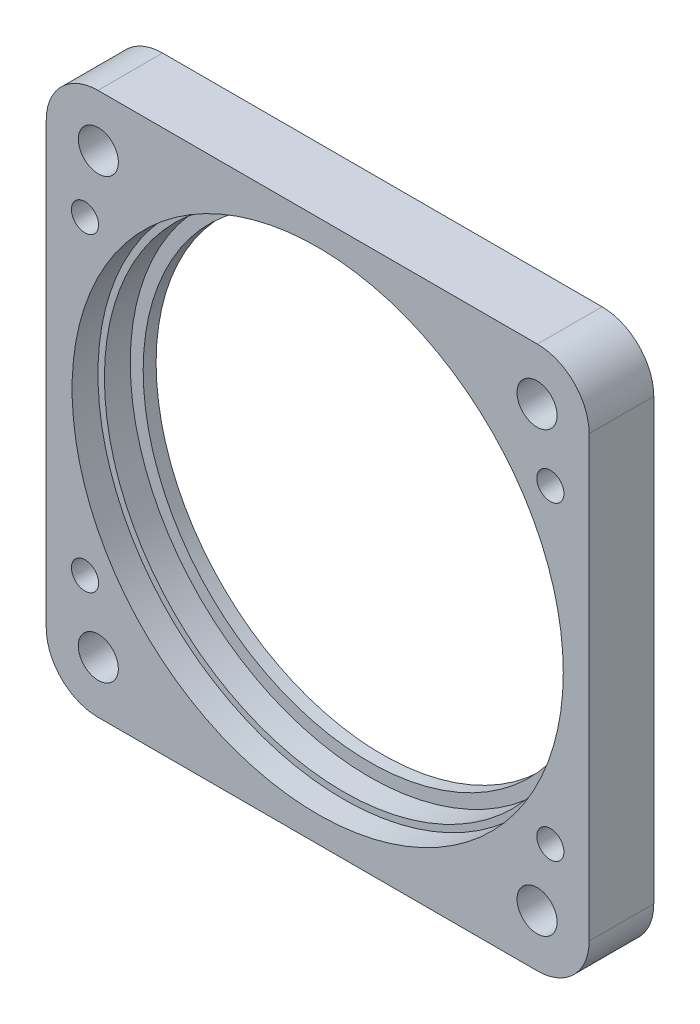
ISO-10303-21;
HEADER;
FILE_DESCRIPTION(('STEP AP214'),'2;1');
FILE_NAME('part.step','',(''),(''),'','','');
FILE_SCHEMA(('AUTOMOTIVE_DESIGN { 1 0 10303 214 1 1 1 1 }'));
ENDSEC;
DATA;
#1=APPLICATION_CONTEXT('core data for automotive mechanical design processes');
#2=APPLICATION_PROTOCOL_DEFINITION('international standard','automotive_design',2000,#1);
#3=PRODUCT_CONTEXT('',#1,'mechanical');
#4=PRODUCT('Part','Part','',(#3));
#5=PRODUCT_RELATED_PRODUCT_CATEGORY('part','',(#4));
#6=PRODUCT_DEFINITION_FORMATION('','',#4);
#7=PRODUCT_DEFINITION_CONTEXT('part definition',#1,'design');
#8=PRODUCT_DEFINITION('design','',#6,#7);
#9=PRODUCT_DEFINITION_SHAPE('','',#8);
#10=(LENGTH_UNIT() NAMED_UNIT(*) SI_UNIT(.MILLI.,.METRE.));
#11=(NAMED_UNIT(*) PLANE_ANGLE_UNIT() SI_UNIT($,.RADIAN.));
#12=(NAMED_UNIT(*) SI_UNIT($,.STERADIAN.) SOLID_ANGLE_UNIT());
#13=UNCERTAINTY_MEASURE_WITH_UNIT(LENGTH_MEASURE(1.E-05),#10,'distance_accuracy_value','');
#14=(GEOMETRIC_REPRESENTATION_CONTEXT(3) GLOBAL_UNCERTAINTY_ASSIGNED_CONTEXT((#13)) GLOBAL_UNIT_ASSIGNED_CONTEXT((#10,
#11,#12)) REPRESENTATION_CONTEXT('',''));
#15=CARTESIAN_POINT('',(0.,0.,0.));
#16=DIRECTION('',(0.,0.,1.));
#17=DIRECTION('',(1.,0.,0.));
#18=AXIS2_PLACEMENT_3D('',#15,#16,#17);
#19=CARTESIAN_POINT('',(18.,12.,5.));
#20=DIRECTION('',(0.,0.,-1.));
#21=DIRECTION('',(-1.,0.,0.));
#22=AXIS2_PLACEMENT_3D('',#19,#20,#21);
#23=CYLINDRICAL_SURFACE('',#22,1.05);
#24=CARTESIAN_POINT('',(18.,12.,5.));
#25=DIRECTION('',(0.,0.,-1.));
#26=DIRECTION('',(-1.,0.,0.));
#27=AXIS2_PLACEMENT_3D('',#24,#25,#26);
#28=CIRCLE('',#27,1.05);
#29=CARTESIAN_POINT('',(16.95,12.,5.));
#30=VERTEX_POINT('',#29);
#31=EDGE_CURVE('E196',#30,#30,#28,.T.);
#32=ORIENTED_EDGE('',*,*,#31,.F.);
#33=EDGE_LOOP('',(#32));
#34=FACE_BOUND('',#33,.T.);
#35=CARTESIAN_POINT('',(18.,12.,3.));
#36=DIRECTION('',(0.,0.,-1.));
#37=DIRECTION('',(-1.,0.,0.));
#38=AXIS2_PLACEMENT_3D('',#35,#36,#37);
#39=CIRCLE('',#38,1.05);
#40=CARTESIAN_POINT('',(16.95,12.,3.));
#41=VERTEX_POINT('',#40);
#42=EDGE_CURVE('E43',#41,#41,#39,.F.);
#43=ORIENTED_EDGE('',*,*,#42,.F.);
#44=EDGE_LOOP('',(#43));
#45=FACE_BOUND('',#44,.T.);
#46=ADVANCED_FACE('F39',(#34,#45),#23,.F.);
#47=CARTESIAN_POINT('',(-18.,-12.,5.));
#48=DIRECTION('',(0.,0.,-1.));
#49=DIRECTION('',(-1.,0.,0.));
#50=AXIS2_PLACEMENT_3D('',#47,#48,#49);
#51=CYLINDRICAL_SURFACE('',#50,1.05);
#52=CARTESIAN_POINT('',(-18.,-12.,5.));
#53=DIRECTION('',(0.,0.,-1.));
#54=DIRECTION('',(-1.,0.,0.));
#55=AXIS2_PLACEMENT_3D('',#52,#53,#54);
#56=CIRCLE('',#55,1.05);
#57=CARTESIAN_POINT('',(-19.05,-12.,5.));
#58=VERTEX_POINT('',#57);
#59=EDGE_CURVE('E187',#58,#58,#56,.T.);
#60=ORIENTED_EDGE('',*,*,#59,.F.);
#61=EDGE_LOOP('',(#60));
#62=FACE_BOUND('',#61,.T.);
#63=CARTESIAN_POINT('',(-18.,-12.,3.));
#64=DIRECTION('',(0.,0.,-1.));
#65=DIRECTION('',(-1.,0.,0.));
#66=AXIS2_PLACEMENT_3D('',#63,#64,#65);
#67=CIRCLE('',#66,1.05);
#68=CARTESIAN_POINT('',(-19.05,-12.,3.));
#69=VERTEX_POINT('',#68);
#70=EDGE_CURVE('E175',#69,#69,#67,.F.);
#71=ORIENTED_EDGE('',*,*,#70,.F.);
#72=EDGE_LOOP('',(#71));
#73=FACE_BOUND('',#72,.T.);
#74=ADVANCED_FACE('F259',(#62,#73),#51,.F.);
#75=CARTESIAN_POINT('',(0.,0.,-52.3259018078045));
#76=DIRECTION('',(0.,0.,1.));
#77=DIRECTION('',(1.,0.,0.));
#78=AXIS2_PLACEMENT_3D('',#75,#76,#77);
#79=CYLINDRICAL_SURFACE('',#78,18.5);
#80=CARTESIAN_POINT('',(0.,0.,1.));
#81=DIRECTION('',(0.,0.,1.));
#82=DIRECTION('',(1.,0.,0.));
#83=AXIS2_PLACEMENT_3D('',#80,#81,#82);
#84=CIRCLE('',#83,18.5);
#85=CARTESIAN_POINT('',(18.5,0.,1.));
#86=VERTEX_POINT('',#85);
#87=EDGE_CURVE('E146',#86,#86,#84,.F.);
#88=ORIENTED_EDGE('',*,*,#87,.T.);
#89=EDGE_LOOP('',(#88));
#90=FACE_BOUND('',#89,.T.);
#91=CARTESIAN_POINT('',(0.,0.,3.));
#92=DIRECTION('',(0.,0.,1.));
#93=DIRECTION('',(1.,0.,0.));
#94=AXIS2_PLACEMENT_3D('',#91,#92,#93);
#95=CIRCLE('',#94,18.5);
#96=CARTESIAN_POINT('',(18.5,0.,3.));
#97=VERTEX_POINT('',#96);
#98=EDGE_CURVE('E147',#97,#97,#95,.F.);
#99=ORIENTED_EDGE('',*,*,#98,.F.);
#100=EDGE_LOOP('',(#99));
#101=FACE_BOUND('',#100,.T.);
#102=ADVANCED_FACE('F265',(#90,#101),#79,.F.);
#103=CARTESIAN_POINT('',(0.,0.,0.));
#104=DIRECTION('',(0.,0.,1.));
#105=DIRECTION('',(1.,0.,0.));
#106=AXIS2_PLACEMENT_3D('',#103,#104,#105);
#107=CYLINDRICAL_SURFACE('',#106,17.5);
#108=CARTESIAN_POINT('',(0.,0.,0.));
#109=DIRECTION('',(0.,0.,1.));
#110=DIRECTION('',(1.,0.,0.));
#111=AXIS2_PLACEMENT_3D('',#108,#109,#110);
#112=CIRCLE('',#111,17.5);
#113=CARTESIAN_POINT('',(17.5,0.,0.));
#114=VERTEX_POINT('',#113);
#115=EDGE_CURVE('E145',#114,#114,#112,.T.);
#116=ORIENTED_EDGE('',*,*,#115,.F.);
#117=EDGE_LOOP('',(#116));
#118=FACE_BOUND('',#117,.T.);
#119=CARTESIAN_POINT('',(0.,0.,1.));
#120=DIRECTION('',(0.,0.,1.));
#121=DIRECTION('',(1.,0.,0.));
#122=AXIS2_PLACEMENT_3D('',#119,#120,#121);
#123=CIRCLE('',#122,17.5);
#124=CARTESIAN_POINT('',(17.5,0.,1.));
#125=VERTEX_POINT('',#124);
#126=EDGE_CURVE('E142',#125,#125,#123,.F.);
#127=ORIENTED_EDGE('',*,*,#126,.F.);
#128=EDGE_LOOP('',(#127));
#129=FACE_BOUND('',#128,.T.);
#130=ADVANCED_FACE('F304',(#118,#129),#107,.F.);
#131=CARTESIAN_POINT('',(21.,21.,5.));
#132=DIRECTION('',(-1.,0.,0.));
#133=DIRECTION('',(0.,-1.,0.));
#134=AXIS2_PLACEMENT_3D('',#131,#132,#133);
#135=PLANE('',#134);
#136=DIRECTION('',(0.,1.,0.));
#137=VECTOR('',#136,1.);
#138=CARTESIAN_POINT('',(21.,21.,5.));
#139=LINE('',#138,#137);
#140=CARTESIAN_POINT('',(21.,-17.,5.));
#141=VERTEX_POINT('',#140);
#142=CARTESIAN_POINT('',(21.,17.,5.));
#143=VERTEX_POINT('',#142);
#144=EDGE_CURVE('E133',#141,#143,#139,.T.);
#145=ORIENTED_EDGE('',*,*,#144,.F.);
#146=DIRECTION('',(0.,0.,-1.));
#147=VECTOR('',#146,1.);
#148=CARTESIAN_POINT('',(21.,-17.,5.));
#149=LINE('',#148,#147);
#150=CARTESIAN_POINT('',(21.,-17.,0.));
#151=VERTEX_POINT('',#150);
#152=EDGE_CURVE('E168',#141,#151,#149,.T.);
#153=ORIENTED_EDGE('',*,*,#152,.T.);
#154=DIRECTION('',(0.,1.,0.));
#155=VECTOR('',#154,1.);
#156=CARTESIAN_POINT('',(21.,21.,0.));
#157=LINE('',#156,#155);
#158=CARTESIAN_POINT('',(21.,17.,0.));
#159=VERTEX_POINT('',#158);
#160=EDGE_CURVE('E231',#151,#159,#157,.T.);
#161=ORIENTED_EDGE('',*,*,#160,.T.);
#162=DIRECTION('',(0.,0.,-1.));
#163=VECTOR('',#162,1.);
#164=CARTESIAN_POINT('',(21.,17.,5.));
#165=LINE('',#164,#163);
#166=EDGE_CURVE('E166',#159,#143,#165,.F.);
#167=ORIENTED_EDGE('',*,*,#166,.T.);
#168=EDGE_LOOP('',(#145,#153,#161,#167));
#169=FACE_BOUND('',#168,.T.);
#170=ADVANCED_FACE('F256',(#169),#135,.F.);
#171=CARTESIAN_POINT('',(-21.,21.,5.));
#172=DIRECTION('',(0.,-1.,0.));
#173=DIRECTION('',(0.,0.,-1.));
#174=AXIS2_PLACEMENT_3D('',#171,#172,#173);
#175=PLANE('',#174);
#176=DIRECTION('',(-1.,0.,0.));
#177=VECTOR('',#176,1.);
#178=CARTESIAN_POINT('',(-21.,21.,5.));
#179=LINE('',#178,#177);
#180=CARTESIAN_POINT('',(17.,21.,5.));
#181=VERTEX_POINT('',#180);
#182=CARTESIAN_POINT('',(-17.,21.,5.));
#183=VERTEX_POINT('',#182);
#184=EDGE_CURVE('E136',#181,#183,#179,.T.);
#185=ORIENTED_EDGE('',*,*,#184,.F.);
#186=DIRECTION('',(0.,0.,-1.));
#187=VECTOR('',#186,1.);
#188=CARTESIAN_POINT('',(17.,21.,5.));
#189=LINE('',#188,#187);
#190=CARTESIAN_POINT('',(17.,21.,0.));
#191=VERTEX_POINT('',#190);
#192=EDGE_CURVE('E13',#181,#191,#189,.T.);
#193=ORIENTED_EDGE('',*,*,#192,.T.);
#194=DIRECTION('',(-1.,0.,0.));
#195=VECTOR('',#194,1.);
#196=CARTESIAN_POINT('',(-21.,21.,0.));
#197=LINE('',#196,#195);
#198=CARTESIAN_POINT('',(-17.,21.,0.));
#199=VERTEX_POINT('',#198);
#200=EDGE_CURVE('E138',#191,#199,#197,.T.);
#201=ORIENTED_EDGE('',*,*,#200,.T.);
#202=DIRECTION('',(0.,0.,-1.));
#203=VECTOR('',#202,1.);
#204=CARTESIAN_POINT('',(-17.,21.,5.));
#205=LINE('',#204,#203);
#206=EDGE_CURVE('E48',#199,#183,#205,.F.);
#207=ORIENTED_EDGE('',*,*,#206,.T.);
#208=EDGE_LOOP('',(#185,#193,#201,#207));
#209=FACE_BOUND('',#208,.T.);
#210=ADVANCED_FACE('F240',(#209),#175,.F.);
#211=CARTESIAN_POINT('',(-21.,21.,5.));
#212=DIRECTION('',(1.,0.,0.));
#213=DIRECTION('',(0.,0.,-1.));
#214=AXIS2_PLACEMENT_3D('',#211,#212,#213);
#215=PLANE('',#214);
#216=DIRECTION('',(0.,-1.,0.));
#217=VECTOR('',#216,1.);
#218=CARTESIAN_POINT('',(-21.,21.,0.));
#219=LINE('',#218,#217);
#220=CARTESIAN_POINT('',(-21.,17.,0.));
#221=VERTEX_POINT('',#220);
#222=CARTESIAN_POINT('',(-21.,-17.,0.));
#223=VERTEX_POINT('',#222);
#224=EDGE_CURVE('E134',#221,#223,#219,.T.);
#225=ORIENTED_EDGE('',*,*,#224,.T.);
#226=DIRECTION('',(0.,0.,-1.));
#227=VECTOR('',#226,1.);
#228=CARTESIAN_POINT('',(-21.,-17.,5.));
#229=LINE('',#228,#227);
#230=CARTESIAN_POINT('',(-21.,-17.,5.));
#231=VERTEX_POINT('',#230);
#232=EDGE_CURVE('E112',#223,#231,#229,.F.);
#233=ORIENTED_EDGE('',*,*,#232,.T.);
#234=DIRECTION('',(0.,-1.,0.));
#235=VECTOR('',#234,1.);
#236=CARTESIAN_POINT('',(-21.,21.,5.));
#237=LINE('',#236,#235);
#238=CARTESIAN_POINT('',(-21.,17.,5.));
#239=VERTEX_POINT('',#238);
#240=EDGE_CURVE('E234',#239,#231,#237,.T.);
#241=ORIENTED_EDGE('',*,*,#240,.F.);
#242=DIRECTION('',(0.,0.,-1.));
#243=VECTOR('',#242,1.);
#244=CARTESIAN_POINT('',(-21.,17.,5.));
#245=LINE('',#244,#243);
#246=EDGE_CURVE('E117',#239,#221,#245,.T.);
#247=ORIENTED_EDGE('',*,*,#246,.T.);
#248=EDGE_LOOP('',(#225,#233,#241,#247));
#249=FACE_BOUND('',#248,.T.);
#250=ADVANCED_FACE('F248',(#249),#215,.F.);
#251=CARTESIAN_POINT('',(-21.,-21.,5.));
#252=DIRECTION('',(0.,1.,0.));
#253=DIRECTION('',(0.,0.,1.));
#254=AXIS2_PLACEMENT_3D('',#251,#252,#253);
#255=PLANE('',#254);
#256=DIRECTION('',(1.,0.,0.));
#257=VECTOR('',#256,1.);
#258=CARTESIAN_POINT('',(-21.,-21.,5.));
#259=LINE('',#258,#257);
#260=CARTESIAN_POINT('',(-17.,-21.,5.));
#261=VERTEX_POINT('',#260);
#262=CARTESIAN_POINT('',(17.,-21.,5.));
#263=VERTEX_POINT('',#262);
#264=EDGE_CURVE('E127',#261,#263,#259,.T.);
#265=ORIENTED_EDGE('',*,*,#264,.F.);
#266=DIRECTION('',(0.,0.,-1.));
#267=VECTOR('',#266,1.);
#268=CARTESIAN_POINT('',(-17.,-21.,5.));
#269=LINE('',#268,#267);
#270=CARTESIAN_POINT('',(-17.,-21.,0.));
#271=VERTEX_POINT('',#270);
#272=EDGE_CURVE('E111',#261,#271,#269,.T.);
#273=ORIENTED_EDGE('',*,*,#272,.T.);
#274=DIRECTION('',(1.,0.,0.));
#275=VECTOR('',#274,1.);
#276=CARTESIAN_POINT('',(-21.,-21.,0.));
#277=LINE('',#276,#275);
#278=CARTESIAN_POINT('',(17.,-21.,0.));
#279=VERTEX_POINT('',#278);
#280=EDGE_CURVE('E124',#271,#279,#277,.T.);
#281=ORIENTED_EDGE('',*,*,#280,.T.);
#282=DIRECTION('',(0.,0.,-1.));
#283=VECTOR('',#282,1.);
#284=CARTESIAN_POINT('',(17.,-21.,5.));
#285=LINE('',#284,#283);
#286=EDGE_CURVE('E129',#279,#263,#285,.F.);
#287=ORIENTED_EDGE('',*,*,#286,.T.);
#288=EDGE_LOOP('',(#265,#273,#281,#287));
#289=FACE_BOUND('',#288,.T.);
#290=ADVANCED_FACE('F123',(#289),#255,.F.);
#291=CARTESIAN_POINT('',(0.,0.,5.));
#292=DIRECTION('',(0.,0.,1.));
#293=DIRECTION('',(1.,0.,0.));
#294=AXIS2_PLACEMENT_3D('',#291,#292,#293);
#295=PLANE('',#294);
#296=CARTESIAN_POINT('',(18.,-12.,5.));
#297=DIRECTION('',(0.,0.,-1.));
#298=DIRECTION('',(1.,0.,0.));
#299=AXIS2_PLACEMENT_3D('',#296,#297,#298);
#300=CIRCLE('',#299,1.05);
#301=CARTESIAN_POINT('',(19.05,-12.,5.));
#302=VERTEX_POINT('',#301);
#303=EDGE_CURVE('E183',#302,#302,#300,.T.);
#304=ORIENTED_EDGE('',*,*,#303,.T.);
#305=EDGE_LOOP('',(#304));
#306=FACE_BOUND('',#305,.T.);
#307=ORIENTED_EDGE('',*,*,#59,.T.);
#308=EDGE_LOOP('',(#307));
#309=FACE_BOUND('',#308,.T.);
#310=CARTESIAN_POINT('',(-18.,12.,5.));
#311=DIRECTION('',(0.,0.,-1.));
#312=DIRECTION('',(1.,0.,0.));
#313=AXIS2_PLACEMENT_3D('',#310,#311,#312);
#314=CIRCLE('',#313,1.05);
#315=CARTESIAN_POINT('',(-16.95,12.,5.));
#316=VERTEX_POINT('',#315);
#317=EDGE_CURVE('E192',#316,#316,#314,.T.);
#318=ORIENTED_EDGE('',*,*,#317,.T.);
#319=EDGE_LOOP('',(#318));
#320=FACE_BOUND('',#319,.T.);
#321=ORIENTED_EDGE('',*,*,#31,.T.);
#322=EDGE_LOOP('',(#321));
#323=FACE_BOUND('',#322,.T.);
#324=CARTESIAN_POINT('',(-16.9705627484768,-16.9705627484768,5.));
#325=DIRECTION('',(0.,0.,1.));
#326=DIRECTION('',(1.,0.,0.));
#327=AXIS2_PLACEMENT_3D('',#324,#325,#326);
#328=CIRCLE('',#327,1.55);
#329=CARTESIAN_POINT('',(-15.4205627484768,-16.9705627484768,5.));
#330=VERTEX_POINT('',#329);
#331=EDGE_CURVE('E213',#330,#330,#328,.T.);
#332=ORIENTED_EDGE('',*,*,#331,.F.);
#333=EDGE_LOOP('',(#332));
#334=FACE_BOUND('',#333,.T.);
#335=CARTESIAN_POINT('',(16.9705627484774,-16.9705627484768,5.));
#336=DIRECTION('',(0.,0.,1.));
#337=DIRECTION('',(1.,0.,0.));
#338=AXIS2_PLACEMENT_3D('',#335,#336,#337);
#339=CIRCLE('',#338,1.55);
#340=CARTESIAN_POINT('',(18.5205627484774,-16.9705627484768,5.));
#341=VERTEX_POINT('',#340);
#342=EDGE_CURVE('E207',#341,#341,#339,.T.);
#343=ORIENTED_EDGE('',*,*,#342,.F.);
#344=EDGE_LOOP('',(#343));
#345=FACE_BOUND('',#344,.T.);
#346=CARTESIAN_POINT('',(16.9705627484775,16.9705627484774,5.));
#347=DIRECTION('',(0.,0.,1.));
#348=DIRECTION('',(1.,0.,0.));
#349=AXIS2_PLACEMENT_3D('',#346,#347,#348);
#350=CIRCLE('',#349,1.55);
#351=CARTESIAN_POINT('',(18.5205627484775,16.9705627484774,5.));
#352=VERTEX_POINT('',#351);
#353=EDGE_CURVE('E200',#352,#352,#350,.T.);
#354=ORIENTED_EDGE('',*,*,#353,.F.);
#355=EDGE_LOOP('',(#354));
#356=FACE_BOUND('',#355,.T.);
#357=CARTESIAN_POINT('',(-16.9705627484768,16.9705627484775,5.));
#358=DIRECTION('',(0.,0.,1.));
#359=DIRECTION('',(1.,0.,0.));
#360=AXIS2_PLACEMENT_3D('',#357,#358,#359);
#361=CIRCLE('',#360,1.55);
#362=CARTESIAN_POINT('',(-15.4205627484768,16.9705627484775,5.));
#363=VERTEX_POINT('',#362);
#364=EDGE_CURVE('E203',#363,#363,#361,.T.);
#365=ORIENTED_EDGE('',*,*,#364,.F.);
#366=EDGE_LOOP('',(#365));
#367=FACE_BOUND('',#366,.T.);
#368=CARTESIAN_POINT('',(0.,0.,5.));
#369=DIRECTION('',(0.,0.,1.));
#370=DIRECTION('',(1.,0.,0.));
#371=AXIS2_PLACEMENT_3D('',#368,#369,#370);
#372=CIRCLE('',#371,19.);
#373=CARTESIAN_POINT('',(19.,0.,5.));
#374=VERTEX_POINT('',#373);
#375=EDGE_CURVE('E221',#374,#374,#372,.T.);
#376=ORIENTED_EDGE('',*,*,#375,.F.);
#377=EDGE_LOOP('',(#376));
#378=FACE_BOUND('',#377,.T.);
#379=ORIENTED_EDGE('',*,*,#240,.T.);
#380=CARTESIAN_POINT('',(-17.,-17.,5.));
#381=DIRECTION('',(0.,0.,1.));
#382=DIRECTION('',(1.,0.,0.));
#383=AXIS2_PLACEMENT_3D('',#380,#381,#382);
#384=CIRCLE('',#383,4.);
#385=EDGE_CURVE('E164',#231,#261,#384,.T.);
#386=ORIENTED_EDGE('',*,*,#385,.T.);
#387=ORIENTED_EDGE('',*,*,#264,.T.);
#388=CARTESIAN_POINT('',(17.,-17.,5.));
#389=DIRECTION('',(0.,0.,1.));
#390=DIRECTION('',(1.,0.,0.));
#391=AXIS2_PLACEMENT_3D('',#388,#389,#390);
#392=CIRCLE('',#391,4.);
#393=EDGE_CURVE('E162',#263,#141,#392,.T.);
#394=ORIENTED_EDGE('',*,*,#393,.T.);
#395=ORIENTED_EDGE('',*,*,#144,.T.);
#396=CARTESIAN_POINT('',(17.,17.,5.));
#397=DIRECTION('',(0.,0.,1.));
#398=DIRECTION('',(1.,0.,0.));
#399=AXIS2_PLACEMENT_3D('',#396,#397,#398);
#400=CIRCLE('',#399,4.);
#401=EDGE_CURVE('E62',#143,#181,#400,.T.);
#402=ORIENTED_EDGE('',*,*,#401,.T.);
#403=ORIENTED_EDGE('',*,*,#184,.T.);
#404=CARTESIAN_POINT('',(-17.,17.,5.));
#405=DIRECTION('',(0.,0.,1.));
#406=DIRECTION('',(1.,0.,0.));
#407=AXIS2_PLACEMENT_3D('',#404,#405,#406);
#408=CIRCLE('',#407,4.);
#409=EDGE_CURVE('E159',#183,#239,#408,.T.);
#410=ORIENTED_EDGE('',*,*,#409,.T.);
#411=EDGE_LOOP('',(#379,#386,#387,#394,#395,#402,#403,#410));
#412=FACE_BOUND('',#411,.T.);
#413=ADVANCED_FACE('F246',(#306,#309,#320,#323,#334,#345,#356,#367,#378,#412),#295,.T.);
#414=CARTESIAN_POINT('',(0.,0.,0.));
#415=DIRECTION('',(0.,0.,1.));
#416=DIRECTION('',(1.,0.,0.));
#417=AXIS2_PLACEMENT_3D('',#414,#415,#416);
#418=PLANE('',#417);
#419=CARTESIAN_POINT('',(18.,-12.,0.));
#420=DIRECTION('',(0.,0.,-1.));
#421=DIRECTION('',(1.,0.,0.));
#422=AXIS2_PLACEMENT_3D('',#419,#420,#421);
#423=CIRCLE('',#422,2.);
#424=CARTESIAN_POINT('',(20.,-12.,0.));
#425=VERTEX_POINT('',#424);
#426=EDGE_CURVE('E318',#425,#425,#423,.T.);
#427=ORIENTED_EDGE('',*,*,#426,.F.);
#428=EDGE_LOOP('',(#427));
#429=FACE_BOUND('',#428,.T.);
#430=CARTESIAN_POINT('',(-18.,-12.,0.));
#431=DIRECTION('',(0.,0.,-1.));
#432=DIRECTION('',(-1.,0.,0.));
#433=AXIS2_PLACEMENT_3D('',#430,#431,#432);
#434=CIRCLE('',#433,2.);
#435=CARTESIAN_POINT('',(-20.,-12.,0.));
#436=VERTEX_POINT('',#435);
#437=EDGE_CURVE('E322',#436,#436,#434,.T.);
#438=ORIENTED_EDGE('',*,*,#437,.F.);
#439=EDGE_LOOP('',(#438));
#440=FACE_BOUND('',#439,.T.);
#441=CARTESIAN_POINT('',(-18.,12.,0.));
#442=DIRECTION('',(0.,0.,-1.));
#443=DIRECTION('',(1.,0.,0.));
#444=AXIS2_PLACEMENT_3D('',#441,#442,#443);
#445=CIRCLE('',#444,2.);
#446=CARTESIAN_POINT('',(-16.,12.,0.));
#447=VERTEX_POINT('',#446);
#448=EDGE_CURVE('E326',#447,#447,#445,.T.);
#449=ORIENTED_EDGE('',*,*,#448,.F.);
#450=EDGE_LOOP('',(#449));
#451=FACE_BOUND('',#450,.T.);
#452=CARTESIAN_POINT('',(18.,12.,0.));
#453=DIRECTION('',(0.,0.,-1.));
#454=DIRECTION('',(-1.,0.,0.));
#455=AXIS2_PLACEMENT_3D('',#452,#453,#454);
#456=CIRCLE('',#455,2.);
#457=CARTESIAN_POINT('',(16.,12.,0.));
#458=VERTEX_POINT('',#457);
#459=EDGE_CURVE('E330',#458,#458,#456,.T.);
#460=ORIENTED_EDGE('',*,*,#459,.F.);
#461=EDGE_LOOP('',(#460));
#462=FACE_BOUND('',#461,.T.);
#463=CARTESIAN_POINT('',(-16.9705627484768,-16.9705627484768,0.));
#464=DIRECTION('',(0.,0.,1.));
#465=DIRECTION('',(1.,0.,0.));
#466=AXIS2_PLACEMENT_3D('',#463,#464,#465);
#467=CIRCLE('',#466,1.55);
#468=CARTESIAN_POINT('',(-15.4205627484768,-16.9705627484768,0.));
#469=VERTEX_POINT('',#468);
#470=EDGE_CURVE('E199',#469,#469,#467,.T.);
#471=ORIENTED_EDGE('',*,*,#470,.T.);
#472=EDGE_LOOP('',(#471));
#473=FACE_BOUND('',#472,.T.);
#474=CARTESIAN_POINT('',(16.9705627484774,-16.9705627484768,0.));
#475=DIRECTION('',(0.,0.,1.));
#476=DIRECTION('',(1.,0.,0.));
#477=AXIS2_PLACEMENT_3D('',#474,#475,#476);
#478=CIRCLE('',#477,1.55);
#479=CARTESIAN_POINT('',(18.5205627484774,-16.9705627484768,0.));
#480=VERTEX_POINT('',#479);
#481=EDGE_CURVE('E210',#480,#480,#478,.T.);
#482=ORIENTED_EDGE('',*,*,#481,.T.);
#483=EDGE_LOOP('',(#482));
#484=FACE_BOUND('',#483,.T.);
#485=CARTESIAN_POINT('',(16.9705627484775,16.9705627484774,0.));
#486=DIRECTION('',(0.,0.,1.));
#487=DIRECTION('',(1.,0.,0.));
#488=AXIS2_PLACEMENT_3D('',#485,#486,#487);
#489=CIRCLE('',#488,1.55);
#490=CARTESIAN_POINT('',(18.5205627484775,16.9705627484774,0.));
#491=VERTEX_POINT('',#490);
#492=EDGE_CURVE('E204',#491,#491,#489,.T.);
#493=ORIENTED_EDGE('',*,*,#492,.T.);
#494=EDGE_LOOP('',(#493));
#495=FACE_BOUND('',#494,.T.);
#496=CARTESIAN_POINT('',(-16.9705627484768,16.9705627484775,0.));
#497=DIRECTION('',(0.,0.,1.));
#498=DIRECTION('',(1.,0.,0.));
#499=AXIS2_PLACEMENT_3D('',#496,#497,#498);
#500=CIRCLE('',#499,1.55);
#501=CARTESIAN_POINT('',(-15.4205627484768,16.9705627484775,0.));
#502=VERTEX_POINT('',#501);
#503=EDGE_CURVE('E218',#502,#502,#500,.T.);
#504=ORIENTED_EDGE('',*,*,#503,.T.);
#505=EDGE_LOOP('',(#504));
#506=FACE_BOUND('',#505,.T.);
#507=ORIENTED_EDGE('',*,*,#115,.T.);
#508=EDGE_LOOP('',(#507));
#509=FACE_BOUND('',#508,.T.);
#510=ORIENTED_EDGE('',*,*,#280,.F.);
#511=CARTESIAN_POINT('',(-17.,-17.,0.));
#512=DIRECTION('',(0.,0.,1.));
#513=DIRECTION('',(1.,0.,0.));
#514=AXIS2_PLACEMENT_3D('',#511,#512,#513);
#515=CIRCLE('',#514,4.);
#516=EDGE_CURVE('E107',#271,#223,#515,.F.);
#517=ORIENTED_EDGE('',*,*,#516,.T.);
#518=ORIENTED_EDGE('',*,*,#224,.F.);
#519=CARTESIAN_POINT('',(-17.,17.,0.));
#520=DIRECTION('',(0.,0.,1.));
#521=DIRECTION('',(1.,0.,0.));
#522=AXIS2_PLACEMENT_3D('',#519,#520,#521);
#523=CIRCLE('',#522,4.);
#524=EDGE_CURVE('E128',#221,#199,#523,.F.);
#525=ORIENTED_EDGE('',*,*,#524,.T.);
#526=ORIENTED_EDGE('',*,*,#200,.F.);
#527=CARTESIAN_POINT('',(17.,17.,0.));
#528=DIRECTION('',(0.,0.,1.));
#529=DIRECTION('',(1.,0.,0.));
#530=AXIS2_PLACEMENT_3D('',#527,#528,#529);
#531=CIRCLE('',#530,4.);
#532=EDGE_CURVE('E153',#191,#159,#531,.F.);
#533=ORIENTED_EDGE('',*,*,#532,.T.);
#534=ORIENTED_EDGE('',*,*,#160,.F.);
#535=CARTESIAN_POINT('',(17.,-17.,0.));
#536=DIRECTION('',(0.,0.,1.));
#537=DIRECTION('',(1.,0.,0.));
#538=AXIS2_PLACEMENT_3D('',#535,#536,#537);
#539=CIRCLE('',#538,4.);
#540=EDGE_CURVE('E118',#151,#279,#539,.F.);
#541=ORIENTED_EDGE('',*,*,#540,.T.);
#542=EDGE_LOOP('',(#510,#517,#518,#525,#526,#533,#534,#541));
#543=FACE_BOUND('',#542,.T.);
#544=ADVANCED_FACE('F131',(#429,#440,#451,#462,#473,#484,#495,#506,#509,#543),#418,.F.);
#545=CARTESIAN_POINT('',(0.,0.,1.));
#546=DIRECTION('',(0.,0.,1.));
#547=DIRECTION('',(1.,0.,0.));
#548=AXIS2_PLACEMENT_3D('',#545,#546,#547);
#549=PLANE('',#548);
#550=ORIENTED_EDGE('',*,*,#87,.F.);
#551=EDGE_LOOP('',(#550));
#552=FACE_BOUND('',#551,.T.);
#553=ORIENTED_EDGE('',*,*,#126,.T.);
#554=EDGE_LOOP('',(#553));
#555=FACE_BOUND('',#554,.T.);
#556=ADVANCED_FACE('F294',(#552,#555),#549,.T.);
#557=CARTESIAN_POINT('',(0.,0.,3.));
#558=DIRECTION('',(0.,0.,1.));
#559=DIRECTION('',(1.,0.,0.));
#560=AXIS2_PLACEMENT_3D('',#557,#558,#559);
#561=PLANE('',#560);
#562=CARTESIAN_POINT('',(0.,0.,3.));
#563=DIRECTION('',(0.,0.,1.));
#564=DIRECTION('',(1.,0.,0.));
#565=AXIS2_PLACEMENT_3D('',#562,#563,#564);
#566=CIRCLE('',#565,19.);
#567=CARTESIAN_POINT('',(19.,0.,3.));
#568=VERTEX_POINT('',#567);
#569=EDGE_CURVE('E150',#568,#568,#566,.F.);
#570=ORIENTED_EDGE('',*,*,#569,.F.);
#571=EDGE_LOOP('',(#570));
#572=FACE_BOUND('',#571,.T.);
#573=ORIENTED_EDGE('',*,*,#98,.T.);
#574=EDGE_LOOP('',(#573));
#575=FACE_BOUND('',#574,.T.);
#576=ADVANCED_FACE('F290',(#572,#575),#561,.T.);
#577=CARTESIAN_POINT('',(0.,0.,-52.7401153701776));
#578=DIRECTION('',(0.,0.,1.));
#579=DIRECTION('',(1.,0.,0.));
#580=AXIS2_PLACEMENT_3D('',#577,#578,#579);
#581=CYLINDRICAL_SURFACE('',#580,19.);
#582=ORIENTED_EDGE('',*,*,#569,.T.);
#583=EDGE_LOOP('',(#582));
#584=FACE_BOUND('',#583,.T.);
#585=ORIENTED_EDGE('',*,*,#375,.T.);
#586=EDGE_LOOP('',(#585));
#587=FACE_BOUND('',#586,.T.);
#588=ADVANCED_FACE('F293',(#584,#587),#581,.F.);
#589=CARTESIAN_POINT('',(-17.,-17.,5.));
#590=DIRECTION('',(0.,0.,-1.));
#591=DIRECTION('',(-1.,0.,0.));
#592=AXIS2_PLACEMENT_3D('',#589,#590,#591);
#593=CYLINDRICAL_SURFACE('',#592,4.);
#594=ORIENTED_EDGE('',*,*,#385,.F.);
#595=ORIENTED_EDGE('',*,*,#232,.F.);
#596=ORIENTED_EDGE('',*,*,#516,.F.);
#597=ORIENTED_EDGE('',*,*,#272,.F.);
#598=EDGE_LOOP('',(#594,#595,#596,#597));
#599=FACE_BOUND('',#598,.T.);
#600=ADVANCED_FACE('F110',(#599),#593,.T.);
#601=CARTESIAN_POINT('',(17.,-17.,5.));
#602=DIRECTION('',(0.,0.,-1.));
#603=DIRECTION('',(-1.,0.,0.));
#604=AXIS2_PLACEMENT_3D('',#601,#602,#603);
#605=CYLINDRICAL_SURFACE('',#604,4.);
#606=ORIENTED_EDGE('',*,*,#393,.F.);
#607=ORIENTED_EDGE('',*,*,#286,.F.);
#608=ORIENTED_EDGE('',*,*,#540,.F.);
#609=ORIENTED_EDGE('',*,*,#152,.F.);
#610=EDGE_LOOP('',(#606,#607,#608,#609));
#611=FACE_BOUND('',#610,.T.);
#612=ADVANCED_FACE('F559',(#611),#605,.T.);
#613=CARTESIAN_POINT('',(17.,17.,5.));
#614=DIRECTION('',(0.,0.,-1.));
#615=DIRECTION('',(-1.,0.,0.));
#616=AXIS2_PLACEMENT_3D('',#613,#614,#615);
#617=CYLINDRICAL_SURFACE('',#616,4.);
#618=ORIENTED_EDGE('',*,*,#401,.F.);
#619=ORIENTED_EDGE('',*,*,#166,.F.);
#620=ORIENTED_EDGE('',*,*,#532,.F.);
#621=ORIENTED_EDGE('',*,*,#192,.F.);
#622=EDGE_LOOP('',(#618,#619,#620,#621));
#623=FACE_BOUND('',#622,.T.);
#624=ADVANCED_FACE('F550',(#623),#617,.T.);
#625=CARTESIAN_POINT('',(-17.,17.,5.));
#626=DIRECTION('',(0.,0.,-1.));
#627=DIRECTION('',(-1.,0.,0.));
#628=AXIS2_PLACEMENT_3D('',#625,#626,#627);
#629=CYLINDRICAL_SURFACE('',#628,4.);
#630=ORIENTED_EDGE('',*,*,#409,.F.);
#631=ORIENTED_EDGE('',*,*,#206,.F.);
#632=ORIENTED_EDGE('',*,*,#524,.F.);
#633=ORIENTED_EDGE('',*,*,#246,.F.);
#634=EDGE_LOOP('',(#630,#631,#632,#633));
#635=FACE_BOUND('',#634,.T.);
#636=ADVANCED_FACE('F41',(#635),#629,.T.);
#637=CARTESIAN_POINT('',(-16.9705627484768,16.9705627484775,0.));
#638=DIRECTION('',(0.,0.,1.));
#639=DIRECTION('',(1.,0.,0.));
#640=AXIS2_PLACEMENT_3D('',#637,#638,#639);
#641=CYLINDRICAL_SURFACE('',#640,1.55);
#642=ORIENTED_EDGE('',*,*,#503,.F.);
#643=EDGE_LOOP('',(#642));
#644=FACE_BOUND('',#643,.T.);
#645=ORIENTED_EDGE('',*,*,#364,.T.);
#646=EDGE_LOOP('',(#645));
#647=FACE_BOUND('',#646,.T.);
#648=ADVANCED_FACE('F277',(#644,#647),#641,.F.);
#649=CARTESIAN_POINT('',(16.9705627484775,16.9705627484774,0.));
#650=DIRECTION('',(0.,0.,1.));
#651=DIRECTION('',(1.,0.,0.));
#652=AXIS2_PLACEMENT_3D('',#649,#650,#651);
#653=CYLINDRICAL_SURFACE('',#652,1.55);
#654=ORIENTED_EDGE('',*,*,#492,.F.);
#655=EDGE_LOOP('',(#654));
#656=FACE_BOUND('',#655,.T.);
#657=ORIENTED_EDGE('',*,*,#353,.T.);
#658=EDGE_LOOP('',(#657));
#659=FACE_BOUND('',#658,.T.);
#660=ADVANCED_FACE('F273',(#656,#659),#653,.F.);
#661=CARTESIAN_POINT('',(16.9705627484774,-16.9705627484768,0.));
#662=DIRECTION('',(0.,0.,1.));
#663=DIRECTION('',(1.,0.,0.));
#664=AXIS2_PLACEMENT_3D('',#661,#662,#663);
#665=CYLINDRICAL_SURFACE('',#664,1.55);
#666=ORIENTED_EDGE('',*,*,#481,.F.);
#667=EDGE_LOOP('',(#666));
#668=FACE_BOUND('',#667,.T.);
#669=ORIENTED_EDGE('',*,*,#342,.T.);
#670=EDGE_LOOP('',(#669));
#671=FACE_BOUND('',#670,.T.);
#672=ADVANCED_FACE('F276',(#668,#671),#665,.F.);
#673=CARTESIAN_POINT('',(-16.9705627484768,-16.9705627484768,0.));
#674=DIRECTION('',(0.,0.,1.));
#675=DIRECTION('',(1.,0.,0.));
#676=AXIS2_PLACEMENT_3D('',#673,#674,#675);
#677=CYLINDRICAL_SURFACE('',#676,1.55);
#678=ORIENTED_EDGE('',*,*,#470,.F.);
#679=EDGE_LOOP('',(#678));
#680=FACE_BOUND('',#679,.T.);
#681=ORIENTED_EDGE('',*,*,#331,.T.);
#682=EDGE_LOOP('',(#681));
#683=FACE_BOUND('',#682,.T.);
#684=ADVANCED_FACE('F281',(#680,#683),#677,.F.);
#685=CARTESIAN_POINT('',(-18.,12.,5.));
#686=DIRECTION('',(0.,0.,-1.));
#687=DIRECTION('',(-1.,0.,0.));
#688=AXIS2_PLACEMENT_3D('',#685,#686,#687);
#689=CYLINDRICAL_SURFACE('',#688,1.05);
#690=CARTESIAN_POINT('',(-18.,12.,3.));
#691=DIRECTION('',(0.,0.,1.));
#692=DIRECTION('',(1.,0.,0.));
#693=AXIS2_PLACEMENT_3D('',#690,#691,#692);
#694=CIRCLE('',#693,1.05);
#695=CARTESIAN_POINT('',(-16.95,12.,3.));
#696=VERTEX_POINT('',#695);
#697=EDGE_CURVE('E178',#696,#696,#694,.F.);
#698=ORIENTED_EDGE('',*,*,#697,.T.);
#699=EDGE_LOOP('',(#698));
#700=FACE_BOUND('',#699,.T.);
#701=ORIENTED_EDGE('',*,*,#317,.F.);
#702=EDGE_LOOP('',(#701));
#703=FACE_BOUND('',#702,.T.);
#704=ADVANCED_FACE('F285',(#700,#703),#689,.F.);
#705=CARTESIAN_POINT('',(18.,-12.,5.));
#706=DIRECTION('',(0.,0.,-1.));
#707=DIRECTION('',(-1.,0.,0.));
#708=AXIS2_PLACEMENT_3D('',#705,#706,#707);
#709=CYLINDRICAL_SURFACE('',#708,1.05);
#710=CARTESIAN_POINT('',(18.,-12.,3.));
#711=DIRECTION('',(0.,0.,1.));
#712=DIRECTION('',(1.,0.,0.));
#713=AXIS2_PLACEMENT_3D('',#710,#711,#712);
#714=CIRCLE('',#713,1.05);
#715=CARTESIAN_POINT('',(19.05,-12.,3.));
#716=VERTEX_POINT('',#715);
#717=EDGE_CURVE('E172',#716,#716,#714,.F.);
#718=ORIENTED_EDGE('',*,*,#717,.T.);
#719=EDGE_LOOP('',(#718));
#720=FACE_BOUND('',#719,.T.);
#721=ORIENTED_EDGE('',*,*,#303,.F.);
#722=EDGE_LOOP('',(#721));
#723=FACE_BOUND('',#722,.T.);
#724=ADVANCED_FACE('F272',(#720,#723),#709,.F.);
#725=CARTESIAN_POINT('',(18.,-12.,3.));
#726=DIRECTION('',(0.,0.,1.));
#727=DIRECTION('',(1.,0.,0.));
#728=AXIS2_PLACEMENT_3D('',#725,#726,#727);
#729=PLANE('',#728);
#730=CARTESIAN_POINT('',(18.,-12.,3.));
#731=DIRECTION('',(0.,0.,-1.));
#732=DIRECTION('',(1.,0.,0.));
#733=AXIS2_PLACEMENT_3D('',#730,#731,#732);
#734=CIRCLE('',#733,2.);
#735=CARTESIAN_POINT('',(20.,-12.,3.));
#736=VERTEX_POINT('',#735);
#737=EDGE_CURVE('E419',#736,#736,#734,.T.);
#738=ORIENTED_EDGE('',*,*,#737,.T.);
#739=EDGE_LOOP('',(#738));
#740=FACE_BOUND('',#739,.T.);
#741=ORIENTED_EDGE('',*,*,#717,.F.);
#742=EDGE_LOOP('',(#741));
#743=FACE_BOUND('',#742,.T.);
#744=ADVANCED_FACE('F375',(#740,#743),#729,.F.);
#745=CARTESIAN_POINT('',(18.,-12.,3.));
#746=DIRECTION('',(0.,0.,-1.));
#747=DIRECTION('',(-1.,0.,0.));
#748=AXIS2_PLACEMENT_3D('',#745,#746,#747);
#749=CYLINDRICAL_SURFACE('',#748,2.);
#750=ORIENTED_EDGE('',*,*,#737,.F.);
#751=EDGE_LOOP('',(#750));
#752=FACE_BOUND('',#751,.T.);
#753=ORIENTED_EDGE('',*,*,#426,.T.);
#754=EDGE_LOOP('',(#753));
#755=FACE_BOUND('',#754,.T.);
#756=ADVANCED_FACE('F389',(#752,#755),#749,.F.);
#757=CARTESIAN_POINT('',(-18.,-12.,3.));
#758=DIRECTION('',(0.,0.,-1.));
#759=DIRECTION('',(-1.,0.,0.));
#760=AXIS2_PLACEMENT_3D('',#757,#758,#759);
#761=PLANE('',#760);
#762=CARTESIAN_POINT('',(-18.,-12.,3.));
#763=DIRECTION('',(0.,0.,-1.));
#764=DIRECTION('',(-1.,0.,0.));
#765=AXIS2_PLACEMENT_3D('',#762,#763,#764);
#766=CIRCLE('',#765,2.);
#767=CARTESIAN_POINT('',(-20.,-12.,3.));
#768=VERTEX_POINT('',#767);
#769=EDGE_CURVE('E414',#768,#768,#766,.T.);
#770=ORIENTED_EDGE('',*,*,#769,.T.);
#771=EDGE_LOOP('',(#770));
#772=FACE_BOUND('',#771,.T.);
#773=ORIENTED_EDGE('',*,*,#70,.T.);
#774=EDGE_LOOP('',(#773));
#775=FACE_BOUND('',#774,.T.);
#776=ADVANCED_FACE('F393',(#772,#775),#761,.T.);
#777=CARTESIAN_POINT('',(-18.,-12.,3.));
#778=DIRECTION('',(0.,0.,-1.));
#779=DIRECTION('',(-1.,0.,0.));
#780=AXIS2_PLACEMENT_3D('',#777,#778,#779);
#781=CYLINDRICAL_SURFACE('',#780,2.);
#782=ORIENTED_EDGE('',*,*,#769,.F.);
#783=EDGE_LOOP('',(#782));
#784=FACE_BOUND('',#783,.T.);
#785=ORIENTED_EDGE('',*,*,#437,.T.);
#786=EDGE_LOOP('',(#785));
#787=FACE_BOUND('',#786,.T.);
#788=ADVANCED_FACE('F397',(#784,#787),#781,.F.);
#789=CARTESIAN_POINT('',(-18.,12.,3.));
#790=DIRECTION('',(0.,0.,1.));
#791=DIRECTION('',(1.,0.,0.));
#792=AXIS2_PLACEMENT_3D('',#789,#790,#791);
#793=PLANE('',#792);
#794=CARTESIAN_POINT('',(-18.,12.,3.));
#795=DIRECTION('',(0.,0.,-1.));
#796=DIRECTION('',(1.,0.,0.));
#797=AXIS2_PLACEMENT_3D('',#794,#795,#796);
#798=CIRCLE('',#797,2.);
#799=CARTESIAN_POINT('',(-16.,12.,3.));
#800=VERTEX_POINT('',#799);
#801=EDGE_CURVE('E362',#800,#800,#798,.T.);
#802=ORIENTED_EDGE('',*,*,#801,.T.);
#803=EDGE_LOOP('',(#802));
#804=FACE_BOUND('',#803,.T.);
#805=ORIENTED_EDGE('',*,*,#697,.F.);
#806=EDGE_LOOP('',(#805));
#807=FACE_BOUND('',#806,.T.);
#808=ADVANCED_FACE('F401',(#804,#807),#793,.F.);
#809=CARTESIAN_POINT('',(-18.,12.,3.));
#810=DIRECTION('',(0.,0.,-1.));
#811=DIRECTION('',(-1.,0.,0.));
#812=AXIS2_PLACEMENT_3D('',#809,#810,#811);
#813=CYLINDRICAL_SURFACE('',#812,2.);
#814=ORIENTED_EDGE('',*,*,#801,.F.);
#815=EDGE_LOOP('',(#814));
#816=FACE_BOUND('',#815,.T.);
#817=ORIENTED_EDGE('',*,*,#448,.T.);
#818=EDGE_LOOP('',(#817));
#819=FACE_BOUND('',#818,.T.);
#820=ADVANCED_FACE('F385',(#816,#819),#813,.F.);
#821=CARTESIAN_POINT('',(18.,12.,3.));
#822=DIRECTION('',(0.,0.,-1.));
#823=DIRECTION('',(-1.,0.,0.));
#824=AXIS2_PLACEMENT_3D('',#821,#822,#823);
#825=PLANE('',#824);
#826=CARTESIAN_POINT('',(18.,12.,3.));
#827=DIRECTION('',(0.,0.,-1.));
#828=DIRECTION('',(-1.,0.,0.));
#829=AXIS2_PLACEMENT_3D('',#826,#827,#828);
#830=CIRCLE('',#829,2.);
#831=CARTESIAN_POINT('',(16.,12.,3.));
#832=VERTEX_POINT('',#831);
#833=EDGE_CURVE('E176',#832,#832,#830,.T.);
#834=ORIENTED_EDGE('',*,*,#833,.T.);
#835=EDGE_LOOP('',(#834));
#836=FACE_BOUND('',#835,.T.);
#837=ORIENTED_EDGE('',*,*,#42,.T.);
#838=EDGE_LOOP('',(#837));
#839=FACE_BOUND('',#838,.T.);
#840=ADVANCED_FACE('F381',(#836,#839),#825,.T.);
#841=CARTESIAN_POINT('',(18.,12.,3.));
#842=DIRECTION('',(0.,0.,-1.));
#843=DIRECTION('',(-1.,0.,0.));
#844=AXIS2_PLACEMENT_3D('',#841,#842,#843);
#845=CYLINDRICAL_SURFACE('',#844,2.);
#846=ORIENTED_EDGE('',*,*,#833,.F.);
#847=EDGE_LOOP('',(#846));
#848=FACE_BOUND('',#847,.T.);
#849=ORIENTED_EDGE('',*,*,#459,.T.);
#850=EDGE_LOOP('',(#849));
#851=FACE_BOUND('',#850,.T.);
#852=ADVANCED_FACE('F378',(#848,#851),#845,.F.);
#853=CLOSED_SHELL('',(#46,#74,#102,#130,#170,#210,#250,#290,#413,#544,#556,#576,#588,#600,#612,
#624,#636,#648,#660,#672,#684,#704,#724,#744,#756,#776,#788,#808,#820,#840,#852));
#854=MANIFOLD_SOLID_BREP('B2',#853);
#855=ADVANCED_BREP_SHAPE_REPRESENTATION('',(#18,#854),#14);
#856=SHAPE_DEFINITION_REPRESENTATION(#9,#855);
ENDSEC;
END-ISO-10303-21;
